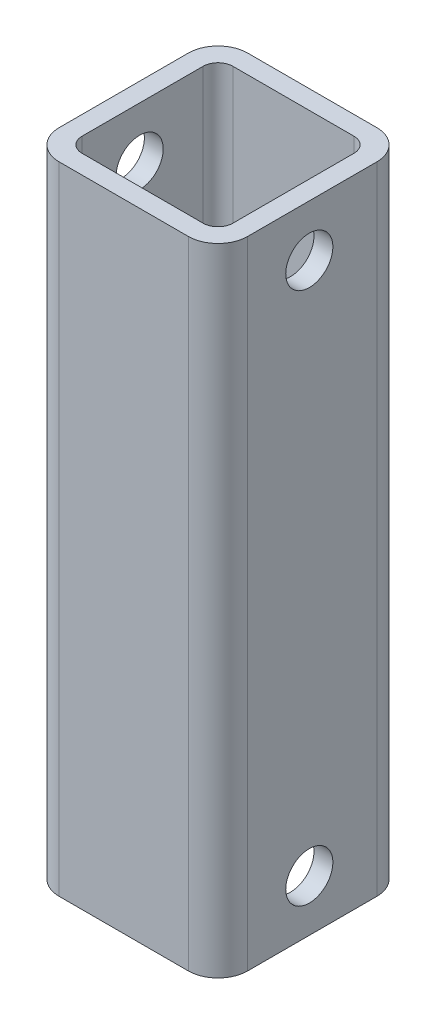
ISO-10303-21;
HEADER;
FILE_DESCRIPTION(('STEP AP214'),'2;1');
FILE_NAME('part.step','',(''),(''),'','','');
FILE_SCHEMA(('AUTOMOTIVE_DESIGN { 1 0 10303 214 1 1 1 1 }'));
ENDSEC;
DATA;
#1=APPLICATION_CONTEXT('core data for automotive mechanical design processes');
#2=APPLICATION_PROTOCOL_DEFINITION('international standard','automotive_design',2000,#1);
#3=PRODUCT_CONTEXT('',#1,'mechanical');
#4=PRODUCT('Part','Part','',(#3));
#5=PRODUCT_RELATED_PRODUCT_CATEGORY('part','',(#4));
#6=PRODUCT_DEFINITION_FORMATION('','',#4);
#7=PRODUCT_DEFINITION_CONTEXT('part definition',#1,'design');
#8=PRODUCT_DEFINITION('design','',#6,#7);
#9=PRODUCT_DEFINITION_SHAPE('','',#8);
#10=(LENGTH_UNIT() NAMED_UNIT(*) SI_UNIT(.MILLI.,.METRE.));
#11=(NAMED_UNIT(*) PLANE_ANGLE_UNIT() SI_UNIT($,.RADIAN.));
#12=(NAMED_UNIT(*) SI_UNIT($,.STERADIAN.) SOLID_ANGLE_UNIT());
#13=UNCERTAINTY_MEASURE_WITH_UNIT(LENGTH_MEASURE(1.E-05),#10,'distance_accuracy_value','');
#14=(GEOMETRIC_REPRESENTATION_CONTEXT(3) GLOBAL_UNCERTAINTY_ASSIGNED_CONTEXT((#13)) GLOBAL_UNIT_ASSIGNED_CONTEXT((#10,
#11,#12)) REPRESENTATION_CONTEXT('',''));
#15=CARTESIAN_POINT('',(0.,0.,0.));
#16=DIRECTION('',(0.,0.,1.));
#17=DIRECTION('',(1.,0.,0.));
#18=AXIS2_PLACEMENT_3D('',#15,#16,#17);
#19=CARTESIAN_POINT('',(4.00000000000003,121.646024484277,-25.4));
#20=DIRECTION('',(0.,0.,1.));
#21=DIRECTION('',(1.,0.,0.));
#22=AXIS2_PLACEMENT_3D('',#19,#20,#21);
#23=PLANE('',#22);
#24=DIRECTION('',(-1.,0.,0.));
#25=VECTOR('',#24,1.);
#26=CARTESIAN_POINT('',(4.00000000000003,85.725,-25.4));
#27=LINE('',#26,#25);
#28=CARTESIAN_POINT('',(21.4,85.725,-25.4));
#29=VERTEX_POINT('',#28);
#30=CARTESIAN_POINT('',(4.00000000000003,85.725,-25.4));
#31=VERTEX_POINT('',#30);
#32=EDGE_CURVE('E252',#29,#31,#27,.T.);
#33=ORIENTED_EDGE('',*,*,#32,.F.);
#34=DIRECTION('',(0.,-1.,0.));
#35=VECTOR('',#34,1.);
#36=CARTESIAN_POINT('',(21.4,121.646024484277,-25.4));
#37=LINE('',#36,#35);
#38=CARTESIAN_POINT('',(21.4,0.,-25.4));
#39=VERTEX_POINT('',#38);
#40=EDGE_CURVE('E50',#29,#39,#37,.T.);
#41=ORIENTED_EDGE('',*,*,#40,.T.);
#42=DIRECTION('',(-1.,0.,0.));
#43=VECTOR('',#42,1.);
#44=CARTESIAN_POINT('',(4.00000000000003,0.,-25.4));
#45=LINE('',#44,#43);
#46=CARTESIAN_POINT('',(4.00000000000003,0.,-25.4));
#47=VERTEX_POINT('',#46);
#48=EDGE_CURVE('E202',#39,#47,#45,.T.);
#49=ORIENTED_EDGE('',*,*,#48,.T.);
#50=DIRECTION('',(0.,-1.,0.));
#51=VECTOR('',#50,1.);
#52=CARTESIAN_POINT('',(4.00000000000003,121.646024484277,-25.4));
#53=LINE('',#52,#51);
#54=EDGE_CURVE('E205',#31,#47,#53,.T.);
#55=ORIENTED_EDGE('',*,*,#54,.F.);
#56=EDGE_LOOP('',(#33,#41,#49,#55));
#57=FACE_BOUND('',#56,.T.);
#58=ADVANCED_FACE('F33',(#57),#23,.F.);
#59=CARTESIAN_POINT('',(21.4,121.646024484277,-21.4));
#60=DIRECTION('',(0.,-1.,0.));
#61=DIRECTION('',(0.,0.,-1.));
#62=AXIS2_PLACEMENT_3D('',#59,#60,#61);
#63=CYLINDRICAL_SURFACE('',#62,4.);
#64=CARTESIAN_POINT('',(21.4,85.725,-21.4));
#65=DIRECTION('',(0.,1.,0.));
#66=DIRECTION('',(0.,0.,1.));
#67=AXIS2_PLACEMENT_3D('',#64,#65,#66);
#68=CIRCLE('',#67,4.);
#69=CARTESIAN_POINT('',(25.4,85.725,-21.4));
#70=VERTEX_POINT('',#69);
#71=EDGE_CURVE('E255',#70,#29,#68,.T.);
#72=ORIENTED_EDGE('',*,*,#71,.F.);
#73=DIRECTION('',(0.,-1.,0.));
#74=VECTOR('',#73,1.);
#75=CARTESIAN_POINT('',(25.4,121.646024484277,-21.4));
#76=LINE('',#75,#74);
#77=CARTESIAN_POINT('',(25.4,0.,-21.4));
#78=VERTEX_POINT('',#77);
#79=EDGE_CURVE('E208',#70,#78,#76,.T.);
#80=ORIENTED_EDGE('',*,*,#79,.T.);
#81=CARTESIAN_POINT('',(21.4,0.,-21.4));
#82=DIRECTION('',(0.,1.,0.));
#83=DIRECTION('',(0.,0.,-1.));
#84=AXIS2_PLACEMENT_3D('',#81,#82,#83);
#85=CIRCLE('',#84,4.);
#86=EDGE_CURVE('E200',#78,#39,#85,.T.);
#87=ORIENTED_EDGE('',*,*,#86,.T.);
#88=ORIENTED_EDGE('',*,*,#40,.F.);
#89=EDGE_LOOP('',(#72,#80,#87,#88));
#90=FACE_BOUND('',#89,.T.);
#91=ADVANCED_FACE('F333',(#90),#63,.T.);
#92=CARTESIAN_POINT('',(25.4,121.646024484277,-4.00000000000003));
#93=DIRECTION('',(-1.,0.,0.));
#94=DIRECTION('',(0.,0.,1.));
#95=AXIS2_PLACEMENT_3D('',#92,#93,#94);
#96=PLANE('',#95);
#97=CARTESIAN_POINT('',(25.4,78.7796874999986,-12.3031250000024));
#98=DIRECTION('',(-1.,0.,0.));
#99=DIRECTION('',(0.,0.,1.));
#100=AXIS2_PLACEMENT_3D('',#97,#98,#99);
#101=CIRCLE('',#100,3.17500000000005);
#102=CARTESIAN_POINT('',(25.4,78.7796874999986,-9.12812500000236));
#103=VERTEX_POINT('',#102);
#104=EDGE_CURVE('E227',#103,#103,#101,.T.);
#105=ORIENTED_EDGE('',*,*,#104,.T.);
#106=EDGE_LOOP('',(#105));
#107=FACE_BOUND('',#106,.T.);
#108=CARTESIAN_POINT('',(25.4,6.94531249999863,-12.3031250000024));
#109=DIRECTION('',(-1.,0.,0.));
#110=DIRECTION('',(0.,0.,1.));
#111=AXIS2_PLACEMENT_3D('',#108,#109,#110);
#112=CIRCLE('',#111,3.17500000000004);
#113=CARTESIAN_POINT('',(25.4,6.94531249999863,-9.12812500000238));
#114=VERTEX_POINT('',#113);
#115=EDGE_CURVE('E160',#114,#114,#112,.T.);
#116=ORIENTED_EDGE('',*,*,#115,.T.);
#117=EDGE_LOOP('',(#116));
#118=FACE_BOUND('',#117,.T.);
#119=DIRECTION('',(0.,0.,-1.));
#120=VECTOR('',#119,1.);
#121=CARTESIAN_POINT('',(25.4,85.725,-4.00000000000003));
#122=LINE('',#121,#120);
#123=CARTESIAN_POINT('',(25.4,85.725,-4.00000000000003));
#124=VERTEX_POINT('',#123);
#125=EDGE_CURVE('E258',#124,#70,#122,.T.);
#126=ORIENTED_EDGE('',*,*,#125,.F.);
#127=DIRECTION('',(0.,-1.,0.));
#128=VECTOR('',#127,1.);
#129=CARTESIAN_POINT('',(25.4,121.646024484277,-4.00000000000003));
#130=LINE('',#129,#128);
#131=CARTESIAN_POINT('',(25.4,0.,-4.00000000000003));
#132=VERTEX_POINT('',#131);
#133=EDGE_CURVE('E210',#124,#132,#130,.T.);
#134=ORIENTED_EDGE('',*,*,#133,.T.);
#135=DIRECTION('',(0.,0.,-1.));
#136=VECTOR('',#135,1.);
#137=CARTESIAN_POINT('',(25.4,0.,-4.00000000000003));
#138=LINE('',#137,#136);
#139=EDGE_CURVE('E197',#132,#78,#138,.T.);
#140=ORIENTED_EDGE('',*,*,#139,.T.);
#141=ORIENTED_EDGE('',*,*,#79,.F.);
#142=EDGE_LOOP('',(#126,#134,#140,#141));
#143=FACE_BOUND('',#142,.T.);
#144=ADVANCED_FACE('F339',(#107,#118,#143),#96,.F.);
#145=CARTESIAN_POINT('',(21.4,121.646024484277,-4.));
#146=DIRECTION('',(0.,-1.,0.));
#147=DIRECTION('',(0.,0.,-1.));
#148=AXIS2_PLACEMENT_3D('',#145,#146,#147);
#149=CYLINDRICAL_SURFACE('',#148,4.);
#150=CARTESIAN_POINT('',(21.4,85.725,-4.));
#151=DIRECTION('',(0.,1.,0.));
#152=DIRECTION('',(0.,0.,1.));
#153=AXIS2_PLACEMENT_3D('',#150,#151,#152);
#154=CIRCLE('',#153,4.);
#155=CARTESIAN_POINT('',(21.4,85.725,0.));
#156=VERTEX_POINT('',#155);
#157=EDGE_CURVE('E261',#156,#124,#154,.T.);
#158=ORIENTED_EDGE('',*,*,#157,.F.);
#159=DIRECTION('',(0.,-1.,0.));
#160=VECTOR('',#159,1.);
#161=CARTESIAN_POINT('',(21.4,121.646024484277,0.));
#162=LINE('',#161,#160);
#163=CARTESIAN_POINT('',(21.4,0.,0.));
#164=VERTEX_POINT('',#163);
#165=EDGE_CURVE('E212',#156,#164,#162,.T.);
#166=ORIENTED_EDGE('',*,*,#165,.T.);
#167=CARTESIAN_POINT('',(21.4,0.,-4.));
#168=DIRECTION('',(0.,1.,0.));
#169=DIRECTION('',(0.,0.,1.));
#170=AXIS2_PLACEMENT_3D('',#167,#168,#169);
#171=CIRCLE('',#170,4.);
#172=EDGE_CURVE('E194',#164,#132,#171,.T.);
#173=ORIENTED_EDGE('',*,*,#172,.T.);
#174=ORIENTED_EDGE('',*,*,#133,.F.);
#175=EDGE_LOOP('',(#158,#166,#173,#174));
#176=FACE_BOUND('',#175,.T.);
#177=ADVANCED_FACE('F344',(#176),#149,.T.);
#178=CARTESIAN_POINT('',(4.00000000000003,121.646024484277,0.));
#179=DIRECTION('',(0.,0.,-1.));
#180=DIRECTION('',(-1.,0.,0.));
#181=AXIS2_PLACEMENT_3D('',#178,#179,#180);
#182=PLANE('',#181);
#183=DIRECTION('',(1.,0.,0.));
#184=VECTOR('',#183,1.);
#185=CARTESIAN_POINT('',(4.00000000000003,85.725,0.));
#186=LINE('',#185,#184);
#187=CARTESIAN_POINT('',(4.00000000000003,85.725,0.));
#188=VERTEX_POINT('',#187);
#189=EDGE_CURVE('E264',#188,#156,#186,.T.);
#190=ORIENTED_EDGE('',*,*,#189,.F.);
#191=DIRECTION('',(0.,-1.,0.));
#192=VECTOR('',#191,1.);
#193=CARTESIAN_POINT('',(4.00000000000003,121.646024484277,0.));
#194=LINE('',#193,#192);
#195=CARTESIAN_POINT('',(4.00000000000003,0.,0.));
#196=VERTEX_POINT('',#195);
#197=EDGE_CURVE('E214',#188,#196,#194,.T.);
#198=ORIENTED_EDGE('',*,*,#197,.T.);
#199=DIRECTION('',(1.,0.,0.));
#200=VECTOR('',#199,1.);
#201=CARTESIAN_POINT('',(4.00000000000003,0.,0.));
#202=LINE('',#201,#200);
#203=EDGE_CURVE('E191',#196,#164,#202,.T.);
#204=ORIENTED_EDGE('',*,*,#203,.T.);
#205=ORIENTED_EDGE('',*,*,#165,.F.);
#206=EDGE_LOOP('',(#190,#198,#204,#205));
#207=FACE_BOUND('',#206,.T.);
#208=ADVANCED_FACE('F348',(#207),#182,.F.);
#209=CARTESIAN_POINT('',(4.,121.646024484277,-4.));
#210=DIRECTION('',(0.,-1.,0.));
#211=DIRECTION('',(0.,0.,-1.));
#212=AXIS2_PLACEMENT_3D('',#209,#210,#211);
#213=CYLINDRICAL_SURFACE('',#212,4.);
#214=CARTESIAN_POINT('',(4.,85.725,-4.));
#215=DIRECTION('',(0.,1.,0.));
#216=DIRECTION('',(0.,0.,1.));
#217=AXIS2_PLACEMENT_3D('',#214,#215,#216);
#218=CIRCLE('',#217,4.);
#219=CARTESIAN_POINT('',(0.,85.725,-4.00000000000003));
#220=VERTEX_POINT('',#219);
#221=EDGE_CURVE('E267',#220,#188,#218,.T.);
#222=ORIENTED_EDGE('',*,*,#221,.F.);
#223=DIRECTION('',(0.,-1.,0.));
#224=VECTOR('',#223,1.);
#225=CARTESIAN_POINT('',(0.,121.646024484277,-4.00000000000003));
#226=LINE('',#225,#224);
#227=CARTESIAN_POINT('',(0.,0.,-4.00000000000003));
#228=VERTEX_POINT('',#227);
#229=EDGE_CURVE('E216',#220,#228,#226,.T.);
#230=ORIENTED_EDGE('',*,*,#229,.T.);
#231=CARTESIAN_POINT('',(4.,0.,-4.));
#232=DIRECTION('',(0.,1.,0.));
#233=DIRECTION('',(0.,0.,-1.));
#234=AXIS2_PLACEMENT_3D('',#231,#232,#233);
#235=CIRCLE('',#234,4.);
#236=EDGE_CURVE('E188',#228,#196,#235,.T.);
#237=ORIENTED_EDGE('',*,*,#236,.T.);
#238=ORIENTED_EDGE('',*,*,#197,.F.);
#239=EDGE_LOOP('',(#222,#230,#237,#238));
#240=FACE_BOUND('',#239,.T.);
#241=ADVANCED_FACE('F352',(#240),#213,.T.);
#242=CARTESIAN_POINT('',(0.,121.646024484277,-4.00000000000003));
#243=DIRECTION('',(1.,0.,0.));
#244=DIRECTION('',(0.,0.,-1.));
#245=AXIS2_PLACEMENT_3D('',#242,#243,#244);
#246=PLANE('',#245);
#247=CARTESIAN_POINT('',(0.,78.7796874999986,-12.3031250000024));
#248=DIRECTION('',(1.,0.,0.));
#249=DIRECTION('',(0.,0.,-1.));
#250=AXIS2_PLACEMENT_3D('',#247,#248,#249);
#251=CIRCLE('',#250,3.17500000000005);
#252=CARTESIAN_POINT('',(0.,78.7796874999986,-15.4781250000025));
#253=VERTEX_POINT('',#252);
#254=EDGE_CURVE('E366',#253,#253,#251,.T.);
#255=ORIENTED_EDGE('',*,*,#254,.T.);
#256=EDGE_LOOP('',(#255));
#257=FACE_BOUND('',#256,.T.);
#258=CARTESIAN_POINT('',(0.,6.94531249999863,-12.3031250000024));
#259=DIRECTION('',(1.,0.,0.));
#260=DIRECTION('',(0.,0.,-1.));
#261=AXIS2_PLACEMENT_3D('',#258,#259,#260);
#262=CIRCLE('',#261,3.17500000000004);
#263=CARTESIAN_POINT('',(0.,6.94531249999863,-15.4781250000024));
#264=VERTEX_POINT('',#263);
#265=EDGE_CURVE('E221',#264,#264,#262,.T.);
#266=ORIENTED_EDGE('',*,*,#265,.T.);
#267=EDGE_LOOP('',(#266));
#268=FACE_BOUND('',#267,.T.);
#269=DIRECTION('',(0.,0.,1.));
#270=VECTOR('',#269,1.);
#271=CARTESIAN_POINT('',(0.,85.725,-4.00000000000003));
#272=LINE('',#271,#270);
#273=CARTESIAN_POINT('',(0.,85.725,-21.4));
#274=VERTEX_POINT('',#273);
#275=EDGE_CURVE('E270',#274,#220,#272,.T.);
#276=ORIENTED_EDGE('',*,*,#275,.F.);
#277=DIRECTION('',(0.,-1.,0.));
#278=VECTOR('',#277,1.);
#279=CARTESIAN_POINT('',(0.,121.646024484277,-21.4));
#280=LINE('',#279,#278);
#281=CARTESIAN_POINT('',(0.,0.,-21.4));
#282=VERTEX_POINT('',#281);
#283=EDGE_CURVE('E42',#274,#282,#280,.T.);
#284=ORIENTED_EDGE('',*,*,#283,.T.);
#285=DIRECTION('',(0.,0.,1.));
#286=VECTOR('',#285,1.);
#287=CARTESIAN_POINT('',(0.,0.,-4.00000000000003));
#288=LINE('',#287,#286);
#289=EDGE_CURVE('E185',#282,#228,#288,.T.);
#290=ORIENTED_EDGE('',*,*,#289,.T.);
#291=ORIENTED_EDGE('',*,*,#229,.F.);
#292=EDGE_LOOP('',(#276,#284,#290,#291));
#293=FACE_BOUND('',#292,.T.);
#294=ADVANCED_FACE('F355',(#257,#268,#293),#246,.F.);
#295=CARTESIAN_POINT('',(4.,121.646024484277,-21.4));
#296=DIRECTION('',(0.,-1.,0.));
#297=DIRECTION('',(0.,0.,-1.));
#298=AXIS2_PLACEMENT_3D('',#295,#296,#297);
#299=CYLINDRICAL_SURFACE('',#298,4.);
#300=CARTESIAN_POINT('',(4.,85.725,-21.4));
#301=DIRECTION('',(0.,1.,0.));
#302=DIRECTION('',(0.,0.,1.));
#303=AXIS2_PLACEMENT_3D('',#300,#301,#302);
#304=CIRCLE('',#303,4.);
#305=EDGE_CURVE('E273',#31,#274,#304,.T.);
#306=ORIENTED_EDGE('',*,*,#305,.F.);
#307=ORIENTED_EDGE('',*,*,#54,.T.);
#308=CARTESIAN_POINT('',(4.,0.,-21.4));
#309=DIRECTION('',(0.,1.,0.));
#310=DIRECTION('',(0.,0.,-1.));
#311=AXIS2_PLACEMENT_3D('',#308,#309,#310);
#312=CIRCLE('',#311,4.);
#313=EDGE_CURVE('E182',#47,#282,#312,.T.);
#314=ORIENTED_EDGE('',*,*,#313,.T.);
#315=ORIENTED_EDGE('',*,*,#283,.F.);
#316=EDGE_LOOP('',(#306,#307,#314,#315));
#317=FACE_BOUND('',#316,.T.);
#318=ADVANCED_FACE('F35',(#317),#299,.T.);
#319=CARTESIAN_POINT('',(4.,0.,-21.4));
#320=DIRECTION('',(0.,-1.,0.));
#321=DIRECTION('',(0.,0.,-1.));
#322=AXIS2_PLACEMENT_3D('',#319,#320,#321);
#323=PLANE('',#322);
#324=ORIENTED_EDGE('',*,*,#313,.F.);
#325=ORIENTED_EDGE('',*,*,#48,.F.);
#326=ORIENTED_EDGE('',*,*,#86,.F.);
#327=ORIENTED_EDGE('',*,*,#139,.F.);
#328=ORIENTED_EDGE('',*,*,#172,.F.);
#329=ORIENTED_EDGE('',*,*,#203,.F.);
#330=ORIENTED_EDGE('',*,*,#236,.F.);
#331=ORIENTED_EDGE('',*,*,#289,.F.);
#332=EDGE_LOOP('',(#324,#325,#326,#327,#328,#329,#330,#331));
#333=FACE_BOUND('',#332,.T.);
#334=DIRECTION('',(-1.,0.,0.));
#335=VECTOR('',#334,1.);
#336=CARTESIAN_POINT('',(20.86,0.,-22.86));
#337=LINE('',#336,#335);
#338=CARTESIAN_POINT('',(20.86,0.,-22.86));
#339=VERTEX_POINT('',#338);
#340=CARTESIAN_POINT('',(4.54000000000002,0.,-22.86));
#341=VERTEX_POINT('',#340);
#342=EDGE_CURVE('E164',#339,#341,#337,.T.);
#343=ORIENTED_EDGE('',*,*,#342,.T.);
#344=CARTESIAN_POINT('',(4.54,0.,-20.86));
#345=DIRECTION('',(0.,1.,0.));
#346=DIRECTION('',(0.,0.,-1.));
#347=AXIS2_PLACEMENT_3D('',#344,#345,#346);
#348=CIRCLE('',#347,2.);
#349=CARTESIAN_POINT('',(2.54,0.,-20.86));
#350=VERTEX_POINT('',#349);
#351=EDGE_CURVE('E276',#341,#350,#348,.T.);
#352=ORIENTED_EDGE('',*,*,#351,.T.);
#353=DIRECTION('',(0.,0.,1.));
#354=VECTOR('',#353,1.);
#355=CARTESIAN_POINT('',(2.54,0.,-4.54000000000001));
#356=LINE('',#355,#354);
#357=CARTESIAN_POINT('',(2.54,0.,-4.54000000000001));
#358=VERTEX_POINT('',#357);
#359=EDGE_CURVE('E279',#350,#358,#356,.T.);
#360=ORIENTED_EDGE('',*,*,#359,.T.);
#361=CARTESIAN_POINT('',(4.54,0.,-4.54));
#362=DIRECTION('',(0.,1.,0.));
#363=DIRECTION('',(0.,0.,-1.));
#364=AXIS2_PLACEMENT_3D('',#361,#362,#363);
#365=CIRCLE('',#364,2.);
#366=CARTESIAN_POINT('',(4.54000000000002,0.,-2.54));
#367=VERTEX_POINT('',#366);
#368=EDGE_CURVE('E282',#358,#367,#365,.T.);
#369=ORIENTED_EDGE('',*,*,#368,.T.);
#370=DIRECTION('',(1.,0.,0.));
#371=VECTOR('',#370,1.);
#372=CARTESIAN_POINT('',(20.86,0.,-2.54));
#373=LINE('',#372,#371);
#374=CARTESIAN_POINT('',(20.86,0.,-2.54));
#375=VERTEX_POINT('',#374);
#376=EDGE_CURVE('E285',#367,#375,#373,.T.);
#377=ORIENTED_EDGE('',*,*,#376,.T.);
#378=CARTESIAN_POINT('',(20.86,0.,-4.54));
#379=DIRECTION('',(0.,1.,0.));
#380=DIRECTION('',(0.,0.,-1.));
#381=AXIS2_PLACEMENT_3D('',#378,#379,#380);
#382=CIRCLE('',#381,2.);
#383=CARTESIAN_POINT('',(22.86,0.,-4.54000000000001));
#384=VERTEX_POINT('',#383);
#385=EDGE_CURVE('E288',#375,#384,#382,.T.);
#386=ORIENTED_EDGE('',*,*,#385,.T.);
#387=DIRECTION('',(0.,0.,-1.));
#388=VECTOR('',#387,1.);
#389=CARTESIAN_POINT('',(22.86,0.,-4.54000000000001));
#390=LINE('',#389,#388);
#391=CARTESIAN_POINT('',(22.86,0.,-20.86));
#392=VERTEX_POINT('',#391);
#393=EDGE_CURVE('E291',#384,#392,#390,.T.);
#394=ORIENTED_EDGE('',*,*,#393,.T.);
#395=CARTESIAN_POINT('',(20.86,0.,-20.86));
#396=DIRECTION('',(0.,1.,0.));
#397=DIRECTION('',(0.,0.,1.));
#398=AXIS2_PLACEMENT_3D('',#395,#396,#397);
#399=CIRCLE('',#398,2.);
#400=EDGE_CURVE('E294',#392,#339,#399,.T.);
#401=ORIENTED_EDGE('',*,*,#400,.T.);
#402=EDGE_LOOP('',(#343,#352,#360,#369,#377,#386,#394,#401));
#403=FACE_BOUND('',#402,.T.);
#404=ADVANCED_FACE('F296',(#333,#403),#323,.T.);
#405=CARTESIAN_POINT('',(20.86,121.646024484277,-22.86));
#406=DIRECTION('',(0.,0.,1.));
#407=DIRECTION('',(1.,0.,0.));
#408=AXIS2_PLACEMENT_3D('',#405,#406,#407);
#409=PLANE('',#408);
#410=DIRECTION('',(0.,-1.,0.));
#411=VECTOR('',#410,1.);
#412=CARTESIAN_POINT('',(20.86,121.646024484277,-22.86));
#413=LINE('',#412,#411);
#414=CARTESIAN_POINT('',(20.86,85.725,-22.86));
#415=VERTEX_POINT('',#414);
#416=EDGE_CURVE('E155',#415,#339,#413,.T.);
#417=ORIENTED_EDGE('',*,*,#416,.F.);
#418=DIRECTION('',(-1.,0.,0.));
#419=VECTOR('',#418,1.);
#420=CARTESIAN_POINT('',(20.86,85.725,-22.86));
#421=LINE('',#420,#419);
#422=CARTESIAN_POINT('',(4.54000000000002,85.725,-22.86));
#423=VERTEX_POINT('',#422);
#424=EDGE_CURVE('E11',#415,#423,#421,.T.);
#425=ORIENTED_EDGE('',*,*,#424,.T.);
#426=DIRECTION('',(0.,-1.,0.));
#427=VECTOR('',#426,1.);
#428=CARTESIAN_POINT('',(4.54000000000002,121.646024484277,-22.86));
#429=LINE('',#428,#427);
#430=EDGE_CURVE('E166',#423,#341,#429,.T.);
#431=ORIENTED_EDGE('',*,*,#430,.T.);
#432=ORIENTED_EDGE('',*,*,#342,.F.);
#433=EDGE_LOOP('',(#417,#425,#431,#432));
#434=FACE_BOUND('',#433,.T.);
#435=ADVANCED_FACE('F162',(#434),#409,.T.);
#436=CARTESIAN_POINT('',(20.86,121.646024484277,-20.86));
#437=DIRECTION('',(0.,-1.,0.));
#438=DIRECTION('',(0.,0.,-1.));
#439=AXIS2_PLACEMENT_3D('',#436,#437,#438);
#440=CYLINDRICAL_SURFACE('',#439,2.);
#441=DIRECTION('',(0.,-1.,0.));
#442=VECTOR('',#441,1.);
#443=CARTESIAN_POINT('',(22.86,121.646024484277,-20.86));
#444=LINE('',#443,#442);
#445=CARTESIAN_POINT('',(22.86,85.725,-20.86));
#446=VERTEX_POINT('',#445);
#447=EDGE_CURVE('E157',#446,#392,#444,.T.);
#448=ORIENTED_EDGE('',*,*,#447,.F.);
#449=CARTESIAN_POINT('',(20.86,85.725,-20.86));
#450=DIRECTION('',(0.,1.,0.));
#451=DIRECTION('',(0.,0.,1.));
#452=AXIS2_PLACEMENT_3D('',#449,#450,#451);
#453=CIRCLE('',#452,2.);
#454=EDGE_CURVE('E148',#446,#415,#453,.T.);
#455=ORIENTED_EDGE('',*,*,#454,.T.);
#456=ORIENTED_EDGE('',*,*,#416,.T.);
#457=ORIENTED_EDGE('',*,*,#400,.F.);
#458=EDGE_LOOP('',(#448,#455,#456,#457));
#459=FACE_BOUND('',#458,.T.);
#460=ADVANCED_FACE('F153',(#459),#440,.F.);
#461=CARTESIAN_POINT('',(22.86,121.646024484277,-4.54000000000001));
#462=DIRECTION('',(-1.,0.,0.));
#463=DIRECTION('',(0.,0.,1.));
#464=AXIS2_PLACEMENT_3D('',#461,#462,#463);
#465=PLANE('',#464);
#466=CARTESIAN_POINT('',(22.86,78.7796874999986,-12.3031250000024));
#467=DIRECTION('',(-1.,0.,0.));
#468=DIRECTION('',(0.,0.,1.));
#469=AXIS2_PLACEMENT_3D('',#466,#467,#468);
#470=CIRCLE('',#469,3.17500000000005);
#471=CARTESIAN_POINT('',(22.86,78.7796874999986,-9.12812500000236));
#472=VERTEX_POINT('',#471);
#473=EDGE_CURVE('E232',#472,#472,#470,.T.);
#474=ORIENTED_EDGE('',*,*,#473,.F.);
#475=EDGE_LOOP('',(#474));
#476=FACE_BOUND('',#475,.T.);
#477=CARTESIAN_POINT('',(22.86,6.94531249999863,-12.3031250000024));
#478=DIRECTION('',(-1.,0.,0.));
#479=DIRECTION('',(0.,0.,1.));
#480=AXIS2_PLACEMENT_3D('',#477,#478,#479);
#481=CIRCLE('',#480,3.17500000000004);
#482=CARTESIAN_POINT('',(22.86,6.94531249999863,-9.12812500000238));
#483=VERTEX_POINT('',#482);
#484=EDGE_CURVE('E220',#483,#483,#481,.T.);
#485=ORIENTED_EDGE('',*,*,#484,.F.);
#486=EDGE_LOOP('',(#485));
#487=FACE_BOUND('',#486,.T.);
#488=DIRECTION('',(0.,-1.,0.));
#489=VECTOR('',#488,1.);
#490=CARTESIAN_POINT('',(22.86,121.646024484277,-4.54000000000001));
#491=LINE('',#490,#489);
#492=CARTESIAN_POINT('',(22.86,85.725,-4.54000000000001));
#493=VERTEX_POINT('',#492);
#494=EDGE_CURVE('E168',#493,#384,#491,.T.);
#495=ORIENTED_EDGE('',*,*,#494,.F.);
#496=DIRECTION('',(0.,0.,-1.));
#497=VECTOR('',#496,1.);
#498=CARTESIAN_POINT('',(22.86,85.725,-4.54000000000001));
#499=LINE('',#498,#497);
#500=EDGE_CURVE('E159',#493,#446,#499,.T.);
#501=ORIENTED_EDGE('',*,*,#500,.T.);
#502=ORIENTED_EDGE('',*,*,#447,.T.);
#503=ORIENTED_EDGE('',*,*,#393,.F.);
#504=EDGE_LOOP('',(#495,#501,#502,#503));
#505=FACE_BOUND('',#504,.T.);
#506=ADVANCED_FACE('F302',(#476,#487,#505),#465,.T.);
#507=CARTESIAN_POINT('',(20.86,121.646024484277,-4.54));
#508=DIRECTION('',(0.,-1.,0.));
#509=DIRECTION('',(0.,0.,-1.));
#510=AXIS2_PLACEMENT_3D('',#507,#508,#509);
#511=CYLINDRICAL_SURFACE('',#510,2.);
#512=DIRECTION('',(0.,-1.,0.));
#513=VECTOR('',#512,1.);
#514=CARTESIAN_POINT('',(20.86,121.646024484277,-2.54));
#515=LINE('',#514,#513);
#516=CARTESIAN_POINT('',(20.86,85.725,-2.54));
#517=VERTEX_POINT('',#516);
#518=EDGE_CURVE('E174',#517,#375,#515,.T.);
#519=ORIENTED_EDGE('',*,*,#518,.F.);
#520=CARTESIAN_POINT('',(20.86,85.725,-4.54));
#521=DIRECTION('',(0.,1.,0.));
#522=DIRECTION('',(0.,0.,1.));
#523=AXIS2_PLACEMENT_3D('',#520,#521,#522);
#524=CIRCLE('',#523,2.);
#525=EDGE_CURVE('E239',#517,#493,#524,.T.);
#526=ORIENTED_EDGE('',*,*,#525,.T.);
#527=ORIENTED_EDGE('',*,*,#494,.T.);
#528=ORIENTED_EDGE('',*,*,#385,.F.);
#529=EDGE_LOOP('',(#519,#526,#527,#528));
#530=FACE_BOUND('',#529,.T.);
#531=ADVANCED_FACE('F306',(#530),#511,.F.);
#532=CARTESIAN_POINT('',(20.86,121.646024484277,-2.54));
#533=DIRECTION('',(0.,0.,-1.));
#534=DIRECTION('',(-1.,0.,0.));
#535=AXIS2_PLACEMENT_3D('',#532,#533,#534);
#536=PLANE('',#535);
#537=DIRECTION('',(0.,-1.,0.));
#538=VECTOR('',#537,1.);
#539=CARTESIAN_POINT('',(4.54000000000002,121.646024484277,-2.54));
#540=LINE('',#539,#538);
#541=CARTESIAN_POINT('',(4.54000000000002,85.725,-2.54));
#542=VERTEX_POINT('',#541);
#543=EDGE_CURVE('E176',#542,#367,#540,.T.);
#544=ORIENTED_EDGE('',*,*,#543,.F.);
#545=DIRECTION('',(1.,0.,0.));
#546=VECTOR('',#545,1.);
#547=CARTESIAN_POINT('',(20.86,85.725,-2.54));
#548=LINE('',#547,#546);
#549=EDGE_CURVE('E242',#542,#517,#548,.T.);
#550=ORIENTED_EDGE('',*,*,#549,.T.);
#551=ORIENTED_EDGE('',*,*,#518,.T.);
#552=ORIENTED_EDGE('',*,*,#376,.F.);
#553=EDGE_LOOP('',(#544,#550,#551,#552));
#554=FACE_BOUND('',#553,.T.);
#555=ADVANCED_FACE('F309',(#554),#536,.T.);
#556=CARTESIAN_POINT('',(4.54,121.646024484277,-4.54));
#557=DIRECTION('',(0.,-1.,0.));
#558=DIRECTION('',(0.,0.,-1.));
#559=AXIS2_PLACEMENT_3D('',#556,#557,#558);
#560=CYLINDRICAL_SURFACE('',#559,2.);
#561=DIRECTION('',(0.,-1.,0.));
#562=VECTOR('',#561,1.);
#563=CARTESIAN_POINT('',(2.54,121.646024484277,-4.54000000000001));
#564=LINE('',#563,#562);
#565=CARTESIAN_POINT('',(2.54,85.725,-4.54000000000001));
#566=VERTEX_POINT('',#565);
#567=EDGE_CURVE('E178',#566,#358,#564,.T.);
#568=ORIENTED_EDGE('',*,*,#567,.F.);
#569=CARTESIAN_POINT('',(4.54,85.725,-4.54));
#570=DIRECTION('',(0.,1.,0.));
#571=DIRECTION('',(0.,0.,1.));
#572=AXIS2_PLACEMENT_3D('',#569,#570,#571);
#573=CIRCLE('',#572,2.);
#574=EDGE_CURVE('E245',#566,#542,#573,.T.);
#575=ORIENTED_EDGE('',*,*,#574,.T.);
#576=ORIENTED_EDGE('',*,*,#543,.T.);
#577=ORIENTED_EDGE('',*,*,#368,.F.);
#578=EDGE_LOOP('',(#568,#575,#576,#577));
#579=FACE_BOUND('',#578,.T.);
#580=ADVANCED_FACE('F313',(#579),#560,.F.);
#581=CARTESIAN_POINT('',(2.54,121.646024484277,-4.54000000000001));
#582=DIRECTION('',(1.,0.,0.));
#583=DIRECTION('',(0.,0.,-1.));
#584=AXIS2_PLACEMENT_3D('',#581,#582,#583);
#585=PLANE('',#584);
#586=CARTESIAN_POINT('',(2.54,78.7796874999986,-12.3031250000024));
#587=DIRECTION('',(1.,0.,0.));
#588=DIRECTION('',(0.,0.,-1.));
#589=AXIS2_PLACEMENT_3D('',#586,#587,#588);
#590=CIRCLE('',#589,3.17500000000005);
#591=CARTESIAN_POINT('',(2.54,78.7796874999986,-15.4781250000025));
#592=VERTEX_POINT('',#591);
#593=EDGE_CURVE('E37',#592,#592,#590,.T.);
#594=ORIENTED_EDGE('',*,*,#593,.F.);
#595=EDGE_LOOP('',(#594));
#596=FACE_BOUND('',#595,.T.);
#597=CARTESIAN_POINT('',(2.54,6.94531249999863,-12.3031250000024));
#598=DIRECTION('',(1.,0.,0.));
#599=DIRECTION('',(0.,0.,-1.));
#600=AXIS2_PLACEMENT_3D('',#597,#598,#599);
#601=CIRCLE('',#600,3.17500000000004);
#602=CARTESIAN_POINT('',(2.54,6.94531249999863,-15.4781250000024));
#603=VERTEX_POINT('',#602);
#604=EDGE_CURVE('E218',#603,#603,#601,.T.);
#605=ORIENTED_EDGE('',*,*,#604,.F.);
#606=EDGE_LOOP('',(#605));
#607=FACE_BOUND('',#606,.T.);
#608=DIRECTION('',(0.,-1.,0.));
#609=VECTOR('',#608,1.);
#610=CARTESIAN_POINT('',(2.54,121.646024484277,-20.86));
#611=LINE('',#610,#609);
#612=CARTESIAN_POINT('',(2.54,85.725,-20.86));
#613=VERTEX_POINT('',#612);
#614=EDGE_CURVE('E180',#613,#350,#611,.T.);
#615=ORIENTED_EDGE('',*,*,#614,.F.);
#616=DIRECTION('',(0.,0.,1.));
#617=VECTOR('',#616,1.);
#618=CARTESIAN_POINT('',(2.54,85.725,-4.54000000000001));
#619=LINE('',#618,#617);
#620=EDGE_CURVE('E248',#613,#566,#619,.T.);
#621=ORIENTED_EDGE('',*,*,#620,.T.);
#622=ORIENTED_EDGE('',*,*,#567,.T.);
#623=ORIENTED_EDGE('',*,*,#359,.F.);
#624=EDGE_LOOP('',(#615,#621,#622,#623));
#625=FACE_BOUND('',#624,.T.);
#626=ADVANCED_FACE('F317',(#596,#607,#625),#585,.T.);
#627=CARTESIAN_POINT('',(4.54,121.646024484277,-20.86));
#628=DIRECTION('',(0.,-1.,0.));
#629=DIRECTION('',(0.,0.,-1.));
#630=AXIS2_PLACEMENT_3D('',#627,#628,#629);
#631=CYLINDRICAL_SURFACE('',#630,2.);
#632=ORIENTED_EDGE('',*,*,#430,.F.);
#633=CARTESIAN_POINT('',(4.54,85.725,-20.86));
#634=DIRECTION('',(0.,1.,0.));
#635=DIRECTION('',(0.,0.,1.));
#636=AXIS2_PLACEMENT_3D('',#633,#634,#635);
#637=CIRCLE('',#636,2.);
#638=EDGE_CURVE('E58',#423,#613,#637,.T.);
#639=ORIENTED_EDGE('',*,*,#638,.T.);
#640=ORIENTED_EDGE('',*,*,#614,.T.);
#641=ORIENTED_EDGE('',*,*,#351,.F.);
#642=EDGE_LOOP('',(#632,#639,#640,#641));
#643=FACE_BOUND('',#642,.T.);
#644=ADVANCED_FACE('F319',(#643),#631,.F.);
#645=CARTESIAN_POINT('',(-1.5875,85.725,0.));
#646=DIRECTION('',(0.,1.,0.));
#647=DIRECTION('',(0.,0.,-1.));
#648=AXIS2_PLACEMENT_3D('',#645,#646,#647);
#649=PLANE('',#648);
#650=ORIENTED_EDGE('',*,*,#638,.F.);
#651=ORIENTED_EDGE('',*,*,#424,.F.);
#652=ORIENTED_EDGE('',*,*,#454,.F.);
#653=ORIENTED_EDGE('',*,*,#500,.F.);
#654=ORIENTED_EDGE('',*,*,#525,.F.);
#655=ORIENTED_EDGE('',*,*,#549,.F.);
#656=ORIENTED_EDGE('',*,*,#574,.F.);
#657=ORIENTED_EDGE('',*,*,#620,.F.);
#658=EDGE_LOOP('',(#650,#651,#652,#653,#654,#655,#656,#657));
#659=FACE_BOUND('',#658,.T.);
#660=ORIENTED_EDGE('',*,*,#32,.T.);
#661=ORIENTED_EDGE('',*,*,#305,.T.);
#662=ORIENTED_EDGE('',*,*,#275,.T.);
#663=ORIENTED_EDGE('',*,*,#221,.T.);
#664=ORIENTED_EDGE('',*,*,#189,.T.);
#665=ORIENTED_EDGE('',*,*,#157,.T.);
#666=ORIENTED_EDGE('',*,*,#125,.T.);
#667=ORIENTED_EDGE('',*,*,#71,.T.);
#668=EDGE_LOOP('',(#660,#661,#662,#663,#664,#665,#666,#667));
#669=FACE_BOUND('',#668,.T.);
#670=ADVANCED_FACE('F146',(#659,#669),#649,.T.);
#671=CARTESIAN_POINT('',(0.,6.94531249999863,-12.3031250000024));
#672=DIRECTION('',(1.,0.,0.));
#673=DIRECTION('',(0.,0.,-1.));
#674=AXIS2_PLACEMENT_3D('',#671,#672,#673);
#675=CYLINDRICAL_SURFACE('',#674,3.17500000000004);
#676=ORIENTED_EDGE('',*,*,#604,.T.);
#677=EDGE_LOOP('',(#676));
#678=FACE_BOUND('',#677,.T.);
#679=ORIENTED_EDGE('',*,*,#265,.F.);
#680=EDGE_LOOP('',(#679));
#681=FACE_BOUND('',#680,.T.);
#682=ADVANCED_FACE('F326',(#678,#681),#675,.F.);
#683=ORIENTED_EDGE('',*,*,#484,.T.);
#684=EDGE_LOOP('',(#683));
#685=FACE_BOUND('',#684,.T.);
#686=ORIENTED_EDGE('',*,*,#115,.F.);
#687=EDGE_LOOP('',(#686));
#688=FACE_BOUND('',#687,.T.);
#689=ADVANCED_FACE('F422',(#685,#688),#675,.F.);
#690=CARTESIAN_POINT('',(0.,78.7796874999986,-12.3031250000024));
#691=DIRECTION('',(1.,0.,0.));
#692=DIRECTION('',(0.,0.,-1.));
#693=AXIS2_PLACEMENT_3D('',#690,#691,#692);
#694=CYLINDRICAL_SURFACE('',#693,3.17500000000005);
#695=ORIENTED_EDGE('',*,*,#593,.T.);
#696=EDGE_LOOP('',(#695));
#697=FACE_BOUND('',#696,.T.);
#698=ORIENTED_EDGE('',*,*,#254,.F.);
#699=EDGE_LOOP('',(#698));
#700=FACE_BOUND('',#699,.T.);
#701=ADVANCED_FACE('F431',(#697,#700),#694,.F.);
#702=ORIENTED_EDGE('',*,*,#473,.T.);
#703=EDGE_LOOP('',(#702));
#704=FACE_BOUND('',#703,.T.);
#705=ORIENTED_EDGE('',*,*,#104,.F.);
#706=EDGE_LOOP('',(#705));
#707=FACE_BOUND('',#706,.T.);
#708=ADVANCED_FACE('F440',(#704,#707),#694,.F.);
#709=CLOSED_SHELL('',(#58,#91,#144,#177,#208,#241,#294,#318,#404,#435,#460,#506,#531,#555,#580,
#626,#644,#670,#682,#689,#701,#708));
#710=MANIFOLD_SOLID_BREP('B2',#709);
#711=ADVANCED_BREP_SHAPE_REPRESENTATION('',(#18,#710),#14);
#712=SHAPE_DEFINITION_REPRESENTATION(#9,#711);
ENDSEC;
END-ISO-10303-21;
